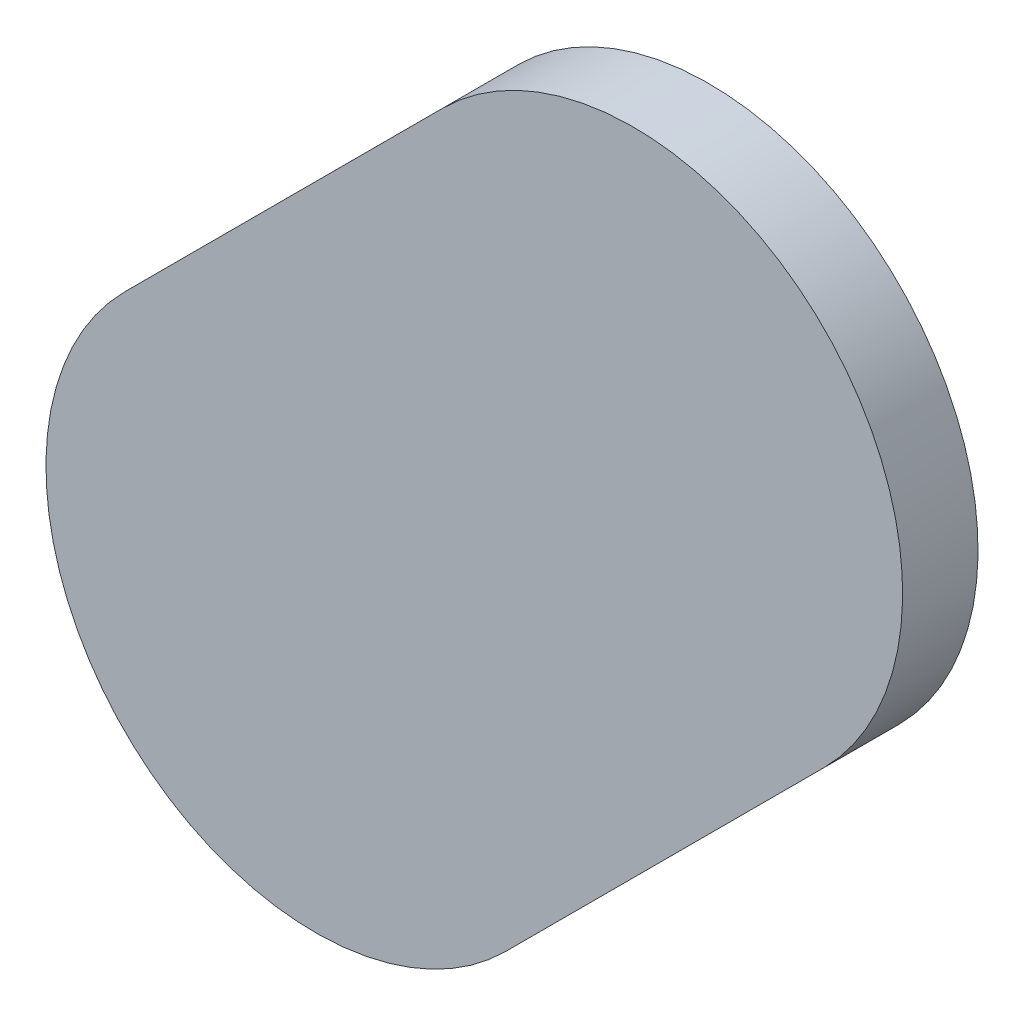
ISO-10303-21;
HEADER;
FILE_DESCRIPTION(('STEP AP214'),'2;1');
FILE_NAME('part.step','',(''),(''),'','','');
FILE_SCHEMA(('AUTOMOTIVE_DESIGN { 1 0 10303 214 1 1 1 1 }'));
ENDSEC;
DATA;
#1=APPLICATION_CONTEXT('core data for automotive mechanical design processes');
#2=APPLICATION_PROTOCOL_DEFINITION('international standard','automotive_design',2000,#1);
#3=PRODUCT_CONTEXT('',#1,'mechanical');
#4=PRODUCT('Part','Part','',(#3));
#5=PRODUCT_RELATED_PRODUCT_CATEGORY('part','',(#4));
#6=PRODUCT_DEFINITION_FORMATION('','',#4);
#7=PRODUCT_DEFINITION_CONTEXT('part definition',#1,'design');
#8=PRODUCT_DEFINITION('design','',#6,#7);
#9=PRODUCT_DEFINITION_SHAPE('','',#8);
#10=(LENGTH_UNIT() NAMED_UNIT(*) SI_UNIT(.MILLI.,.METRE.));
#11=(NAMED_UNIT(*) PLANE_ANGLE_UNIT() SI_UNIT($,.RADIAN.));
#12=(NAMED_UNIT(*) SI_UNIT($,.STERADIAN.) SOLID_ANGLE_UNIT());
#13=UNCERTAINTY_MEASURE_WITH_UNIT(LENGTH_MEASURE(1.E-05),#10,'distance_accuracy_value','');
#14=(GEOMETRIC_REPRESENTATION_CONTEXT(3) GLOBAL_UNCERTAINTY_ASSIGNED_CONTEXT((#13)) GLOBAL_UNIT_ASSIGNED_CONTEXT((#10,
#11,#12)) REPRESENTATION_CONTEXT('',''));
#15=CARTESIAN_POINT('',(0.,0.,0.));
#16=DIRECTION('',(0.,0.,1.));
#17=DIRECTION('',(1.,0.,0.));
#18=AXIS2_PLACEMENT_3D('',#15,#16,#17);
#19=CARTESIAN_POINT('',(100.0567849,84.09714956,0.));
#20=DIRECTION('',(-0.707112768365389,0.707100793957011,0.));
#21=DIRECTION('',(0.707100793957011,0.707112768365389,0.));
#22=AXIS2_PLACEMENT_3D('',#19,#20,#21);
#23=PLANE('',#22);
#24=DIRECTION('',(0.707100793957011,0.707112768365389,0.));
#25=VECTOR('',#24,1.);
#26=CARTESIAN_POINT('',(100.0567849,84.09714956,0.03556));
#27=LINE('',#26,#25);
#28=CARTESIAN_POINT('',(100.0567849,84.09714956,0.03556));
#29=VERTEX_POINT('',#28);
#30=CARTESIAN_POINT('',(100.20677444,84.24714164,0.03556));
#31=VERTEX_POINT('',#30);
#32=EDGE_CURVE('E11',#29,#31,#27,.T.);
#33=ORIENTED_EDGE('',*,*,#32,.F.);
#34=DIRECTION('',(0.,0.,1.));
#35=VECTOR('',#34,1.);
#36=CARTESIAN_POINT('',(100.0567849,84.09714956,0.));
#37=LINE('',#36,#35);
#38=CARTESIAN_POINT('',(100.0567849,84.09714956,0.));
#39=VERTEX_POINT('',#38);
#40=EDGE_CURVE('E24',#39,#29,#37,.T.);
#41=ORIENTED_EDGE('',*,*,#40,.F.);
#42=DIRECTION('',(0.707100793957011,0.707112768365389,0.));
#43=VECTOR('',#42,1.);
#44=CARTESIAN_POINT('',(100.0567849,84.09714956,0.));
#45=LINE('',#44,#43);
#46=CARTESIAN_POINT('',(100.20677444,84.24714164,0.));
#47=VERTEX_POINT('',#46);
#48=EDGE_CURVE('E75',#39,#47,#45,.T.);
#49=ORIENTED_EDGE('',*,*,#48,.T.);
#50=DIRECTION('',(0.,0.,1.));
#51=VECTOR('',#50,1.);
#52=CARTESIAN_POINT('',(100.20677444,84.24714164,0.));
#53=LINE('',#52,#51);
#54=EDGE_CURVE('E37',#47,#31,#53,.T.);
#55=ORIENTED_EDGE('',*,*,#54,.T.);
#56=EDGE_LOOP('',(#33,#41,#49,#55));
#57=FACE_BOUND('',#56,.T.);
#58=ADVANCED_FACE('F17',(#57),#23,.F.);
#59=CARTESIAN_POINT('',(100.11697274,84.33694334,0.));
#60=DIRECTION('',(0.,0.,-1.));
#61=DIRECTION('',(0.707106781186548,-0.707106781186548,0.));
#62=AXIS2_PLACEMENT_3D('',#59,#60,#61);
#63=CYLINDRICAL_SURFACE('',#62,0.126998782064163);
#64=CARTESIAN_POINT('',(100.11697274,84.33694334,0.03556));
#65=DIRECTION('',(0.,0.,1.));
#66=DIRECTION('',(0.707106781186548,-0.707106781186548,0.));
#67=AXIS2_PLACEMENT_3D('',#64,#65,#66);
#68=CIRCLE('',#67,0.126998782064163);
#69=CARTESIAN_POINT('',(100.02717104,84.42674504,0.03556));
#70=VERTEX_POINT('',#69);
#71=EDGE_CURVE('E83',#31,#70,#68,.T.);
#72=ORIENTED_EDGE('',*,*,#71,.F.);
#73=ORIENTED_EDGE('',*,*,#54,.F.);
#74=CARTESIAN_POINT('',(100.11697274,84.33694334,0.));
#75=DIRECTION('',(0.,0.,1.));
#76=DIRECTION('',(0.707106781186548,-0.707106781186548,0.));
#77=AXIS2_PLACEMENT_3D('',#74,#75,#76);
#78=CIRCLE('',#77,0.126998782064163);
#79=CARTESIAN_POINT('',(100.02717104,84.42674504,0.));
#80=VERTEX_POINT('',#79);
#81=EDGE_CURVE('E81',#47,#80,#78,.T.);
#82=ORIENTED_EDGE('',*,*,#81,.T.);
#83=DIRECTION('',(0.,0.,1.));
#84=VECTOR('',#83,1.);
#85=CARTESIAN_POINT('',(100.02717104,84.42674504,0.));
#86=LINE('',#85,#84);
#87=EDGE_CURVE('E67',#80,#70,#86,.T.);
#88=ORIENTED_EDGE('',*,*,#87,.T.);
#89=EDGE_LOOP('',(#72,#73,#82,#88));
#90=FACE_BOUND('',#89,.T.);
#91=ADVANCED_FACE('F89',(#90),#63,.T.);
#92=CARTESIAN_POINT('',(100.02717104,84.42674504,0.));
#93=DIRECTION('',(0.707100793956977,-0.707112768365423,0.));
#94=DIRECTION('',(-0.707112768365423,-0.707100793956977,0.));
#95=AXIS2_PLACEMENT_3D('',#92,#93,#94);
#96=PLANE('',#95);
#97=DIRECTION('',(-0.707112768365423,-0.707100793956977,0.));
#98=VECTOR('',#97,1.);
#99=CARTESIAN_POINT('',(100.02717104,84.42674504,0.03556));
#100=LINE('',#99,#98);
#101=CARTESIAN_POINT('',(99.87717896,84.2767555,0.03556));
#102=VERTEX_POINT('',#101);
#103=EDGE_CURVE('E71',#70,#102,#100,.T.);
#104=ORIENTED_EDGE('',*,*,#103,.F.);
#105=ORIENTED_EDGE('',*,*,#87,.F.);
#106=DIRECTION('',(-0.707112768365423,-0.707100793956977,0.));
#107=VECTOR('',#106,1.);
#108=CARTESIAN_POINT('',(100.02717104,84.42674504,0.));
#109=LINE('',#108,#107);
#110=CARTESIAN_POINT('',(99.87717896,84.2767555,0.));
#111=VERTEX_POINT('',#110);
#112=EDGE_CURVE('E63',#80,#111,#109,.T.);
#113=ORIENTED_EDGE('',*,*,#112,.T.);
#114=DIRECTION('',(0.,0.,1.));
#115=VECTOR('',#114,1.);
#116=CARTESIAN_POINT('',(99.87717896,84.2767555,0.));
#117=LINE('',#116,#115);
#118=EDGE_CURVE('E53',#111,#102,#117,.T.);
#119=ORIENTED_EDGE('',*,*,#118,.T.);
#120=EDGE_LOOP('',(#104,#105,#113,#119));
#121=FACE_BOUND('',#120,.T.);
#122=ADVANCED_FACE('F66',(#121),#96,.F.);
#123=CARTESIAN_POINT('',(99.96698193,84.18695253,0.));
#124=DIRECTION('',(0.,0.,-1.));
#125=DIRECTION('',(-0.707106781186604,0.707106781186492,0.));
#126=AXIS2_PLACEMENT_3D('',#123,#124,#125);
#127=CYLINDRICAL_SURFACE('',#126,0.127000578115382);
#128=CARTESIAN_POINT('',(99.96698193,84.18695253,0.03556));
#129=DIRECTION('',(0.,0.,1.));
#130=DIRECTION('',(-0.707106781186604,0.707106781186492,0.));
#131=AXIS2_PLACEMENT_3D('',#128,#129,#130);
#132=CIRCLE('',#131,0.127000578115382);
#133=EDGE_CURVE('E59',#102,#29,#132,.T.);
#134=ORIENTED_EDGE('',*,*,#133,.F.);
#135=ORIENTED_EDGE('',*,*,#118,.F.);
#136=CARTESIAN_POINT('',(99.96698193,84.18695253,0.));
#137=DIRECTION('',(0.,0.,1.));
#138=DIRECTION('',(-0.707106781186604,0.707106781186492,0.));
#139=AXIS2_PLACEMENT_3D('',#136,#137,#138);
#140=CIRCLE('',#139,0.127000578115382);
#141=EDGE_CURVE('E57',#111,#39,#140,.T.);
#142=ORIENTED_EDGE('',*,*,#141,.T.);
#143=ORIENTED_EDGE('',*,*,#40,.T.);
#144=EDGE_LOOP('',(#134,#135,#142,#143));
#145=FACE_BOUND('',#144,.T.);
#146=ADVANCED_FACE('F55',(#145),#127,.T.);
#147=CARTESIAN_POINT('',(100.0567849,84.09714956,0.));
#148=DIRECTION('',(0.,0.,-1.));
#149=DIRECTION('',(-1.,0.,0.));
#150=AXIS2_PLACEMENT_3D('',#147,#148,#149);
#151=PLANE('',#150);
#152=ORIENTED_EDGE('',*,*,#141,.F.);
#153=ORIENTED_EDGE('',*,*,#112,.F.);
#154=ORIENTED_EDGE('',*,*,#81,.F.);
#155=ORIENTED_EDGE('',*,*,#48,.F.);
#156=EDGE_LOOP('',(#152,#153,#154,#155));
#157=FACE_BOUND('',#156,.T.);
#158=ADVANCED_FACE('F74',(#157),#151,.T.);
#159=CARTESIAN_POINT('',(100.0567849,84.09714956,0.03556));
#160=DIRECTION('',(0.,0.,-1.));
#161=DIRECTION('',(-1.,0.,0.));
#162=AXIS2_PLACEMENT_3D('',#159,#160,#161);
#163=PLANE('',#162);
#164=ORIENTED_EDGE('',*,*,#32,.T.);
#165=ORIENTED_EDGE('',*,*,#71,.T.);
#166=ORIENTED_EDGE('',*,*,#103,.T.);
#167=ORIENTED_EDGE('',*,*,#133,.T.);
#168=EDGE_LOOP('',(#164,#165,#166,#167));
#169=FACE_BOUND('',#168,.T.);
#170=ADVANCED_FACE('F91',(#169),#163,.F.);
#171=CLOSED_SHELL('',(#58,#91,#122,#146,#158,#170));
#172=MANIFOLD_SOLID_BREP('B1',#171);
#173=ADVANCED_BREP_SHAPE_REPRESENTATION('',(#18,#172),#14);
#174=SHAPE_DEFINITION_REPRESENTATION(#9,#173);
ENDSEC;
END-ISO-10303-21;
